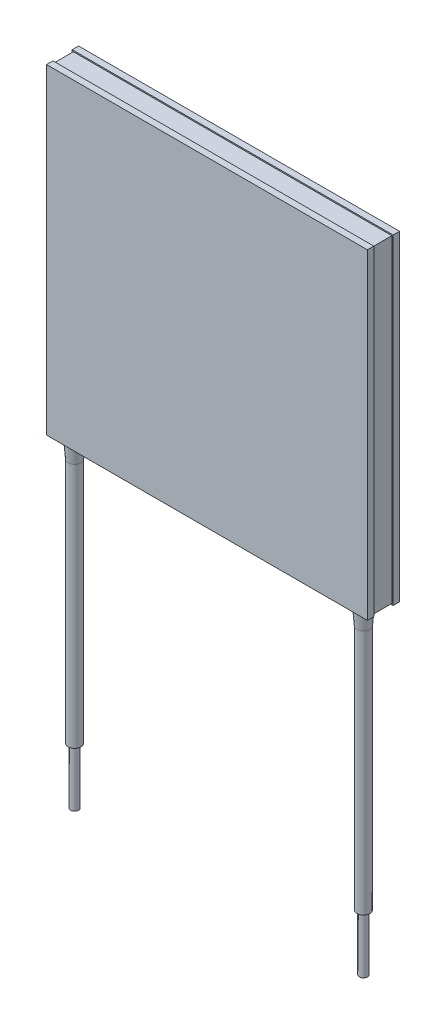
ISO-10303-21;
HEADER;
FILE_DESCRIPTION(('STEP AP214'),'2;1');
FILE_NAME('part.step','',(''),(''),'','','');
FILE_SCHEMA(('AUTOMOTIVE_DESIGN { 1 0 10303 214 1 1 1 1 }'));
ENDSEC;
DATA;
#1=APPLICATION_CONTEXT('core data for automotive mechanical design processes');
#2=APPLICATION_PROTOCOL_DEFINITION('international standard','automotive_design',2000,#1);
#3=PRODUCT_CONTEXT('',#1,'mechanical');
#4=PRODUCT('Part','Part','',(#3));
#5=PRODUCT_RELATED_PRODUCT_CATEGORY('part','',(#4));
#6=PRODUCT_DEFINITION_FORMATION('','',#4);
#7=PRODUCT_DEFINITION_CONTEXT('part definition',#1,'design');
#8=PRODUCT_DEFINITION('design','',#6,#7);
#9=PRODUCT_DEFINITION_SHAPE('','',#8);
#10=(LENGTH_UNIT() NAMED_UNIT(*) SI_UNIT(.MILLI.,.METRE.));
#11=(NAMED_UNIT(*) PLANE_ANGLE_UNIT() SI_UNIT($,.RADIAN.));
#12=(NAMED_UNIT(*) SI_UNIT($,.STERADIAN.) SOLID_ANGLE_UNIT());
#13=UNCERTAINTY_MEASURE_WITH_UNIT(LENGTH_MEASURE(1.E-05),#10,'distance_accuracy_value','');
#14=(GEOMETRIC_REPRESENTATION_CONTEXT(3) GLOBAL_UNCERTAINTY_ASSIGNED_CONTEXT((#13)) GLOBAL_UNIT_ASSIGNED_CONTEXT((#10,
#11,#12)) REPRESENTATION_CONTEXT('',''));
#15=CARTESIAN_POINT('',(0.,0.,0.));
#16=DIRECTION('',(0.,0.,1.));
#17=DIRECTION('',(1.,0.,0.));
#18=AXIS2_PLACEMENT_3D('',#15,#16,#17);
#19=CARTESIAN_POINT('',(17.5,-60.,2.5));
#20=DIRECTION('',(0.,1.,0.));
#21=DIRECTION('',(1.,0.,0.));
#22=AXIS2_PLACEMENT_3D('',#19,#20,#21);
#23=PLANE('',#22);
#24=CARTESIAN_POINT('',(18.,-60.,2.5));
#25=DIRECTION('',(0.,-1.,0.));
#26=DIRECTION('',(1.,0.,0.));
#27=AXIS2_PLACEMENT_3D('',#24,#25,#26);
#28=CIRCLE('',#27,0.5);
#29=CARTESIAN_POINT('',(17.5,-60.,2.5));
#30=VERTEX_POINT('',#29);
#31=EDGE_CURVE('E292',#30,#30,#28,.T.);
#32=ORIENTED_EDGE('',*,*,#31,.T.);
#33=EDGE_LOOP('',(#32));
#34=FACE_BOUND('',#33,.T.);
#35=ADVANCED_FACE('F17',(#34),#23,.F.);
#36=CARTESIAN_POINT('',(17.2,-53.,2.5));
#37=DIRECTION('',(0.,1.,0.));
#38=DIRECTION('',(1.,0.,0.));
#39=AXIS2_PLACEMENT_3D('',#36,#37,#38);
#40=PLANE('',#39);
#41=CARTESIAN_POINT('',(18.,-53.,2.5));
#42=DIRECTION('',(0.,-1.,0.));
#43=DIRECTION('',(1.,0.,0.));
#44=AXIS2_PLACEMENT_3D('',#41,#42,#43);
#45=CIRCLE('',#44,0.5);
#46=CARTESIAN_POINT('',(17.5,-53.,2.5));
#47=VERTEX_POINT('',#46);
#48=EDGE_CURVE('E293',#47,#47,#45,.T.);
#49=ORIENTED_EDGE('',*,*,#48,.F.);
#50=EDGE_LOOP('',(#49));
#51=FACE_BOUND('',#50,.T.);
#52=CARTESIAN_POINT('',(18.,-53.,2.5));
#53=DIRECTION('',(0.,-1.,0.));
#54=DIRECTION('',(1.,0.,0.));
#55=AXIS2_PLACEMENT_3D('',#52,#53,#54);
#56=CIRCLE('',#55,0.8);
#57=CARTESIAN_POINT('',(17.2,-53.,2.5));
#58=VERTEX_POINT('',#57);
#59=EDGE_CURVE('E329',#58,#58,#56,.T.);
#60=ORIENTED_EDGE('',*,*,#59,.T.);
#61=EDGE_LOOP('',(#60));
#62=FACE_BOUND('',#61,.T.);
#63=ADVANCED_FACE('F889',(#51,#62),#40,.F.);
#64=CARTESIAN_POINT('',(-17.5,-60.,2.5));
#65=DIRECTION('',(0.,1.,0.));
#66=DIRECTION('',(1.,0.,0.));
#67=AXIS2_PLACEMENT_3D('',#64,#65,#66);
#68=PLANE('',#67);
#69=CARTESIAN_POINT('',(-18.,-60.,2.5));
#70=DIRECTION('',(0.,1.,0.));
#71=DIRECTION('',(-1.,0.,0.));
#72=AXIS2_PLACEMENT_3D('',#69,#70,#71);
#73=CIRCLE('',#72,0.5);
#74=CARTESIAN_POINT('',(-17.5,-60.,2.5));
#75=VERTEX_POINT('',#74);
#76=EDGE_CURVE('E294',#75,#75,#73,.T.);
#77=ORIENTED_EDGE('',*,*,#76,.F.);
#78=EDGE_LOOP('',(#77));
#79=FACE_BOUND('',#78,.T.);
#80=ADVANCED_FACE('F884',(#79),#68,.F.);
#81=CARTESIAN_POINT('',(-17.2,-53.,2.5));
#82=DIRECTION('',(0.,1.,0.));
#83=DIRECTION('',(1.,0.,0.));
#84=AXIS2_PLACEMENT_3D('',#81,#82,#83);
#85=PLANE('',#84);
#86=CARTESIAN_POINT('',(-18.,-53.,2.5));
#87=DIRECTION('',(0.,1.,0.));
#88=DIRECTION('',(-1.,0.,0.));
#89=AXIS2_PLACEMENT_3D('',#86,#87,#88);
#90=CIRCLE('',#89,0.5);
#91=CARTESIAN_POINT('',(-17.5,-53.,2.5));
#92=VERTEX_POINT('',#91);
#93=EDGE_CURVE('E275',#92,#92,#90,.T.);
#94=ORIENTED_EDGE('',*,*,#93,.T.);
#95=EDGE_LOOP('',(#94));
#96=FACE_BOUND('',#95,.T.);
#97=CARTESIAN_POINT('',(-18.,-53.,2.5));
#98=DIRECTION('',(0.,1.,0.));
#99=DIRECTION('',(-1.,0.,0.));
#100=AXIS2_PLACEMENT_3D('',#97,#98,#99);
#101=CIRCLE('',#100,0.8);
#102=CARTESIAN_POINT('',(-17.2,-53.,2.5));
#103=VERTEX_POINT('',#102);
#104=EDGE_CURVE('E271',#103,#103,#101,.T.);
#105=ORIENTED_EDGE('',*,*,#104,.F.);
#106=EDGE_LOOP('',(#105));
#107=FACE_BOUND('',#106,.T.);
#108=ADVANCED_FACE('F877',(#96,#107),#85,.F.);
#109=CARTESIAN_POINT('',(-19.85,0.,0.));
#110=DIRECTION('',(1.,0.,0.));
#111=DIRECTION('',(0.,-1.,0.));
#112=AXIS2_PLACEMENT_3D('',#109,#110,#111);
#113=PLANE('',#112);
#114=DIRECTION('',(0.,1.,0.));
#115=VECTOR('',#114,1.);
#116=CARTESIAN_POINT('',(-19.85,-20.,0.8));
#117=LINE('',#116,#115);
#118=CARTESIAN_POINT('',(-19.85,-19.85,0.8));
#119=VERTEX_POINT('',#118);
#120=CARTESIAN_POINT('',(-19.85,19.85,0.8));
#121=VERTEX_POINT('',#120);
#122=EDGE_CURVE('E238',#119,#121,#117,.T.);
#123=ORIENTED_EDGE('',*,*,#122,.F.);
#124=DIRECTION('',(0.,0.,-1.));
#125=VECTOR('',#124,1.);
#126=CARTESIAN_POINT('',(-19.85,-19.85,0.));
#127=LINE('',#126,#125);
#128=CARTESIAN_POINT('',(-19.85,-19.85,3.2));
#129=VERTEX_POINT('',#128);
#130=EDGE_CURVE('E11',#129,#119,#127,.T.);
#131=ORIENTED_EDGE('',*,*,#130,.F.);
#132=DIRECTION('',(0.,-1.,0.));
#133=VECTOR('',#132,1.);
#134=CARTESIAN_POINT('',(-19.85,-20.,3.2));
#135=LINE('',#134,#133);
#136=CARTESIAN_POINT('',(-19.85,19.85,3.2));
#137=VERTEX_POINT('',#136);
#138=EDGE_CURVE('E244',#137,#129,#135,.T.);
#139=ORIENTED_EDGE('',*,*,#138,.F.);
#140=DIRECTION('',(0.,0.,1.));
#141=VECTOR('',#140,1.);
#142=CARTESIAN_POINT('',(-19.85,19.85,0.));
#143=LINE('',#142,#141);
#144=EDGE_CURVE('E21',#121,#137,#143,.T.);
#145=ORIENTED_EDGE('',*,*,#144,.F.);
#146=EDGE_LOOP('',(#123,#131,#139,#145));
#147=FACE_BOUND('',#146,.T.);
#148=ADVANCED_FACE('F868',(#147),#113,.F.);
#149=CARTESIAN_POINT('',(0.,-19.85,0.));
#150=DIRECTION('',(0.,1.,0.));
#151=DIRECTION('',(1.,0.,0.));
#152=AXIS2_PLACEMENT_3D('',#149,#150,#151);
#153=PLANE('',#152);
#154=CARTESIAN_POINT('',(18.,-19.85,2.5));
#155=DIRECTION('',(0.,-1.,0.));
#156=DIRECTION('',(0.,0.,1.));
#157=AXIS2_PLACEMENT_3D('',#154,#155,#156);
#158=CIRCLE('',#157,1.);
#159=CARTESIAN_POINT('',(17.2858571571457,-19.85,3.2));
#160=VERTEX_POINT('',#159);
#161=CARTESIAN_POINT('',(17.,-19.85,2.5));
#162=VERTEX_POINT('',#161);
#163=EDGE_CURVE('E231',#160,#162,#158,.T.);
#164=ORIENTED_EDGE('',*,*,#163,.F.);
#165=DIRECTION('',(1.,0.,0.));
#166=VECTOR('',#165,1.);
#167=CARTESIAN_POINT('',(-20.,-19.85,3.2));
#168=LINE('',#167,#166);
#169=CARTESIAN_POINT('',(-17.2858571571457,-19.85,3.2));
#170=VERTEX_POINT('',#169);
#171=EDGE_CURVE('E402',#170,#160,#168,.T.);
#172=ORIENTED_EDGE('',*,*,#171,.F.);
#173=CARTESIAN_POINT('',(-18.,-19.85,2.5));
#174=DIRECTION('',(0.,-1.,0.));
#175=DIRECTION('',(0.,0.,1.));
#176=AXIS2_PLACEMENT_3D('',#173,#174,#175);
#177=CIRCLE('',#176,1.);
#178=CARTESIAN_POINT('',(-17.,-19.85,2.5));
#179=VERTEX_POINT('',#178);
#180=EDGE_CURVE('E263',#179,#170,#177,.T.);
#181=ORIENTED_EDGE('',*,*,#180,.F.);
#182=CARTESIAN_POINT('',(-18.,-19.85,2.5));
#183=DIRECTION('',(0.,-1.,0.));
#184=DIRECTION('',(0.,0.,1.));
#185=AXIS2_PLACEMENT_3D('',#182,#183,#184);
#186=CIRCLE('',#185,1.);
#187=CARTESIAN_POINT('',(-18.7141428428543,-19.85,3.2));
#188=VERTEX_POINT('',#187);
#189=EDGE_CURVE('E315',#188,#179,#186,.T.);
#190=ORIENTED_EDGE('',*,*,#189,.F.);
#191=DIRECTION('',(1.,0.,0.));
#192=VECTOR('',#191,1.);
#193=CARTESIAN_POINT('',(-20.,-19.85,3.2));
#194=LINE('',#193,#192);
#195=EDGE_CURVE('E248',#129,#188,#194,.T.);
#196=ORIENTED_EDGE('',*,*,#195,.F.);
#197=ORIENTED_EDGE('',*,*,#130,.T.);
#198=DIRECTION('',(-1.,0.,0.));
#199=VECTOR('',#198,1.);
#200=CARTESIAN_POINT('',(-20.,-19.85,0.8));
#201=LINE('',#200,#199);
#202=CARTESIAN_POINT('',(19.85,-19.85,0.8));
#203=VERTEX_POINT('',#202);
#204=EDGE_CURVE('E346',#203,#119,#201,.T.);
#205=ORIENTED_EDGE('',*,*,#204,.F.);
#206=DIRECTION('',(0.,0.,-1.));
#207=VECTOR('',#206,1.);
#208=CARTESIAN_POINT('',(19.85,-19.85,0.));
#209=LINE('',#208,#207);
#210=CARTESIAN_POINT('',(19.85,-19.85,3.2));
#211=VERTEX_POINT('',#210);
#212=EDGE_CURVE('E28',#211,#203,#209,.T.);
#213=ORIENTED_EDGE('',*,*,#212,.F.);
#214=DIRECTION('',(1.,0.,0.));
#215=VECTOR('',#214,1.);
#216=CARTESIAN_POINT('',(-20.,-19.85,3.2));
#217=LINE('',#216,#215);
#218=CARTESIAN_POINT('',(18.7141428428543,-19.85,3.2));
#219=VERTEX_POINT('',#218);
#220=EDGE_CURVE('E405',#219,#211,#217,.T.);
#221=ORIENTED_EDGE('',*,*,#220,.F.);
#222=CARTESIAN_POINT('',(18.,-19.85,2.5));
#223=DIRECTION('',(0.,-1.,0.));
#224=DIRECTION('',(0.,0.,1.));
#225=AXIS2_PLACEMENT_3D('',#222,#223,#224);
#226=CIRCLE('',#225,1.);
#227=EDGE_CURVE('E280',#162,#219,#226,.T.);
#228=ORIENTED_EDGE('',*,*,#227,.F.);
#229=EDGE_LOOP('',(#164,#172,#181,#190,#196,#197,#205,#213,#221,#228));
#230=FACE_BOUND('',#229,.T.);
#231=ADVANCED_FACE('F483',(#230),#153,.F.);
#232=CARTESIAN_POINT('',(19.85,0.,0.));
#233=DIRECTION('',(-1.,0.,0.));
#234=DIRECTION('',(0.,1.,0.));
#235=AXIS2_PLACEMENT_3D('',#232,#233,#234);
#236=PLANE('',#235);
#237=DIRECTION('',(0.,-1.,0.));
#238=VECTOR('',#237,1.);
#239=CARTESIAN_POINT('',(19.85,-20.,3.2));
#240=LINE('',#239,#238);
#241=CARTESIAN_POINT('',(19.85,19.85,3.2));
#242=VERTEX_POINT('',#241);
#243=EDGE_CURVE('E409',#242,#211,#240,.T.);
#244=ORIENTED_EDGE('',*,*,#243,.T.);
#245=ORIENTED_EDGE('',*,*,#212,.T.);
#246=DIRECTION('',(0.,1.,0.));
#247=VECTOR('',#246,1.);
#248=CARTESIAN_POINT('',(19.85,-20.,0.8));
#249=LINE('',#248,#247);
#250=CARTESIAN_POINT('',(19.85,19.85,0.8));
#251=VERTEX_POINT('',#250);
#252=EDGE_CURVE('E349',#203,#251,#249,.T.);
#253=ORIENTED_EDGE('',*,*,#252,.T.);
#254=DIRECTION('',(0.,0.,-1.));
#255=VECTOR('',#254,1.);
#256=CARTESIAN_POINT('',(19.85,19.85,0.));
#257=LINE('',#256,#255);
#258=EDGE_CURVE('E284',#242,#251,#257,.T.);
#259=ORIENTED_EDGE('',*,*,#258,.F.);
#260=EDGE_LOOP('',(#244,#245,#253,#259));
#261=FACE_BOUND('',#260,.T.);
#262=ADVANCED_FACE('F487',(#261),#236,.F.);
#263=CARTESIAN_POINT('',(0.,19.85,0.));
#264=DIRECTION('',(0.,-1.,0.));
#265=DIRECTION('',(0.,0.,-1.));
#266=AXIS2_PLACEMENT_3D('',#263,#264,#265);
#267=PLANE('',#266);
#268=DIRECTION('',(-1.,0.,0.));
#269=VECTOR('',#268,1.);
#270=CARTESIAN_POINT('',(-20.,19.85,0.8));
#271=LINE('',#270,#269);
#272=EDGE_CURVE('E242',#251,#121,#271,.T.);
#273=ORIENTED_EDGE('',*,*,#272,.T.);
#274=ORIENTED_EDGE('',*,*,#144,.T.);
#275=DIRECTION('',(1.,0.,0.));
#276=VECTOR('',#275,1.);
#277=CARTESIAN_POINT('',(-20.,19.85,3.2));
#278=LINE('',#277,#276);
#279=EDGE_CURVE('E249',#137,#242,#278,.T.);
#280=ORIENTED_EDGE('',*,*,#279,.T.);
#281=ORIENTED_EDGE('',*,*,#258,.T.);
#282=EDGE_LOOP('',(#273,#274,#280,#281));
#283=FACE_BOUND('',#282,.T.);
#284=ADVANCED_FACE('F19',(#283),#267,.F.);
#285=CARTESIAN_POINT('',(-20.,19.85,0.8));
#286=DIRECTION('',(0.,0.,-1.));
#287=DIRECTION('',(-1.,0.,0.));
#288=AXIS2_PLACEMENT_3D('',#285,#286,#287);
#289=PLANE('',#288);
#290=ORIENTED_EDGE('',*,*,#122,.T.);
#291=ORIENTED_EDGE('',*,*,#272,.F.);
#292=ORIENTED_EDGE('',*,*,#252,.F.);
#293=ORIENTED_EDGE('',*,*,#204,.T.);
#294=EDGE_LOOP('',(#290,#291,#292,#293));
#295=FACE_BOUND('',#294,.T.);
#296=DIRECTION('',(-1.,0.,0.));
#297=VECTOR('',#296,1.);
#298=CARTESIAN_POINT('',(-20.,20.,0.8));
#299=LINE('',#298,#297);
#300=CARTESIAN_POINT('',(20.,20.,0.8));
#301=VERTEX_POINT('',#300);
#302=CARTESIAN_POINT('',(-20.,20.,0.8));
#303=VERTEX_POINT('',#302);
#304=EDGE_CURVE('E192',#301,#303,#299,.T.);
#305=ORIENTED_EDGE('',*,*,#304,.T.);
#306=DIRECTION('',(0.,1.,0.));
#307=VECTOR('',#306,1.);
#308=CARTESIAN_POINT('',(-20.,19.85,0.8));
#309=LINE('',#308,#307);
#310=CARTESIAN_POINT('',(-20.,-20.,0.8));
#311=VERTEX_POINT('',#310);
#312=EDGE_CURVE('E197',#311,#303,#309,.T.);
#313=ORIENTED_EDGE('',*,*,#312,.F.);
#314=DIRECTION('',(1.,0.,0.));
#315=VECTOR('',#314,1.);
#316=CARTESIAN_POINT('',(19.85,-20.,0.8));
#317=LINE('',#316,#315);
#318=CARTESIAN_POINT('',(20.,-20.,0.8));
#319=VERTEX_POINT('',#318);
#320=EDGE_CURVE('E341',#311,#319,#317,.T.);
#321=ORIENTED_EDGE('',*,*,#320,.T.);
#322=DIRECTION('',(0.,1.,0.));
#323=VECTOR('',#322,1.);
#324=CARTESIAN_POINT('',(20.,19.85,0.8));
#325=LINE('',#324,#323);
#326=EDGE_CURVE('E199',#319,#301,#325,.T.);
#327=ORIENTED_EDGE('',*,*,#326,.T.);
#328=EDGE_LOOP('',(#305,#313,#321,#327));
#329=FACE_BOUND('',#328,.T.);
#330=ADVANCED_FACE('F194',(#295,#329),#289,.F.);
#331=CARTESIAN_POINT('',(0.,0.,0.));
#332=DIRECTION('',(0.,0.,1.));
#333=DIRECTION('',(1.,0.,0.));
#334=AXIS2_PLACEMENT_3D('',#331,#332,#333);
#335=PLANE('',#334);
#336=DIRECTION('',(0.,1.,0.));
#337=VECTOR('',#336,1.);
#338=CARTESIAN_POINT('',(20.,20.,0.));
#339=LINE('',#338,#337);
#340=CARTESIAN_POINT('',(20.,-20.,0.));
#341=VERTEX_POINT('',#340);
#342=CARTESIAN_POINT('',(20.,20.,0.));
#343=VERTEX_POINT('',#342);
#344=EDGE_CURVE('E316',#341,#343,#339,.T.);
#345=ORIENTED_EDGE('',*,*,#344,.F.);
#346=DIRECTION('',(1.,0.,0.));
#347=VECTOR('',#346,1.);
#348=CARTESIAN_POINT('',(-20.,-20.,0.));
#349=LINE('',#348,#347);
#350=CARTESIAN_POINT('',(-20.,-20.,0.));
#351=VERTEX_POINT('',#350);
#352=EDGE_CURVE('E344',#351,#341,#349,.T.);
#353=ORIENTED_EDGE('',*,*,#352,.F.);
#354=DIRECTION('',(0.,-1.,0.));
#355=VECTOR('',#354,1.);
#356=CARTESIAN_POINT('',(-20.,20.,0.));
#357=LINE('',#356,#355);
#358=CARTESIAN_POINT('',(-20.,20.,0.));
#359=VERTEX_POINT('',#358);
#360=EDGE_CURVE('E216',#359,#351,#357,.T.);
#361=ORIENTED_EDGE('',*,*,#360,.F.);
#362=DIRECTION('',(-1.,0.,0.));
#363=VECTOR('',#362,1.);
#364=CARTESIAN_POINT('',(-20.,20.,0.));
#365=LINE('',#364,#363);
#366=EDGE_CURVE('E211',#343,#359,#365,.T.);
#367=ORIENTED_EDGE('',*,*,#366,.F.);
#368=EDGE_LOOP('',(#345,#353,#361,#367));
#369=FACE_BOUND('',#368,.T.);
#370=ADVANCED_FACE('F820',(#369),#335,.F.);
#371=CARTESIAN_POINT('',(0.,0.,4.));
#372=DIRECTION('',(0.,0.,1.));
#373=DIRECTION('',(1.,0.,0.));
#374=AXIS2_PLACEMENT_3D('',#371,#372,#373);
#375=PLANE('',#374);
#376=DIRECTION('',(0.,1.,0.));
#377=VECTOR('',#376,1.);
#378=CARTESIAN_POINT('',(20.,20.,4.));
#379=LINE('',#378,#377);
#380=CARTESIAN_POINT('',(20.,-20.,4.));
#381=VERTEX_POINT('',#380);
#382=CARTESIAN_POINT('',(20.,20.,4.));
#383=VERTEX_POINT('',#382);
#384=EDGE_CURVE('E205',#381,#383,#379,.T.);
#385=ORIENTED_EDGE('',*,*,#384,.T.);
#386=DIRECTION('',(-1.,0.,0.));
#387=VECTOR('',#386,1.);
#388=CARTESIAN_POINT('',(-20.,20.,4.));
#389=LINE('',#388,#387);
#390=CARTESIAN_POINT('',(-20.,20.,4.));
#391=VERTEX_POINT('',#390);
#392=EDGE_CURVE('E243',#383,#391,#389,.T.);
#393=ORIENTED_EDGE('',*,*,#392,.T.);
#394=DIRECTION('',(0.,-1.,0.));
#395=VECTOR('',#394,1.);
#396=CARTESIAN_POINT('',(-20.,20.,4.));
#397=LINE('',#396,#395);
#398=CARTESIAN_POINT('',(-20.,-20.,4.));
#399=VERTEX_POINT('',#398);
#400=EDGE_CURVE('E233',#391,#399,#397,.T.);
#401=ORIENTED_EDGE('',*,*,#400,.T.);
#402=DIRECTION('',(1.,0.,0.));
#403=VECTOR('',#402,1.);
#404=CARTESIAN_POINT('',(-20.,-20.,4.));
#405=LINE('',#404,#403);
#406=EDGE_CURVE('E345',#399,#381,#405,.T.);
#407=ORIENTED_EDGE('',*,*,#406,.T.);
#408=EDGE_LOOP('',(#385,#393,#401,#407));
#409=FACE_BOUND('',#408,.T.);
#410=ADVANCED_FACE('F432',(#409),#375,.T.);
#411=CARTESIAN_POINT('',(-20.,20.,4.));
#412=DIRECTION('',(0.,-1.,0.));
#413=DIRECTION('',(0.,0.,-1.));
#414=AXIS2_PLACEMENT_3D('',#411,#412,#413);
#415=PLANE('',#414);
#416=DIRECTION('',(0.,0.,-1.));
#417=VECTOR('',#416,1.);
#418=CARTESIAN_POINT('',(20.,20.,4.));
#419=LINE('',#418,#417);
#420=CARTESIAN_POINT('',(20.,20.,3.2));
#421=VERTEX_POINT('',#420);
#422=EDGE_CURVE('E303',#383,#421,#419,.T.);
#423=ORIENTED_EDGE('',*,*,#422,.T.);
#424=DIRECTION('',(1.,0.,0.));
#425=VECTOR('',#424,1.);
#426=CARTESIAN_POINT('',(-20.,20.,3.2));
#427=LINE('',#426,#425);
#428=CARTESIAN_POINT('',(-20.,20.,3.2));
#429=VERTEX_POINT('',#428);
#430=EDGE_CURVE('E254',#429,#421,#427,.T.);
#431=ORIENTED_EDGE('',*,*,#430,.F.);
#432=DIRECTION('',(0.,0.,-1.));
#433=VECTOR('',#432,1.);
#434=CARTESIAN_POINT('',(-20.,20.,4.));
#435=LINE('',#434,#433);
#436=EDGE_CURVE('E227',#391,#429,#435,.T.);
#437=ORIENTED_EDGE('',*,*,#436,.F.);
#438=ORIENTED_EDGE('',*,*,#392,.F.);
#439=EDGE_LOOP('',(#423,#431,#437,#438));
#440=FACE_BOUND('',#439,.T.);
#441=ADVANCED_FACE('F452',(#440),#415,.F.);
#442=CARTESIAN_POINT('',(20.,20.,4.));
#443=DIRECTION('',(-1.,0.,0.));
#444=DIRECTION('',(0.,1.,0.));
#445=AXIS2_PLACEMENT_3D('',#442,#443,#444);
#446=PLANE('',#445);
#447=ORIENTED_EDGE('',*,*,#326,.F.);
#448=DIRECTION('',(0.,0.,-1.));
#449=VECTOR('',#448,1.);
#450=CARTESIAN_POINT('',(20.,-20.,4.));
#451=LINE('',#450,#449);
#452=EDGE_CURVE('E306',#319,#341,#451,.T.);
#453=ORIENTED_EDGE('',*,*,#452,.T.);
#454=ORIENTED_EDGE('',*,*,#344,.T.);
#455=DIRECTION('',(0.,0.,-1.));
#456=VECTOR('',#455,1.);
#457=CARTESIAN_POINT('',(20.,20.,4.));
#458=LINE('',#457,#456);
#459=EDGE_CURVE('E204',#301,#343,#458,.T.);
#460=ORIENTED_EDGE('',*,*,#459,.F.);
#461=EDGE_LOOP('',(#447,#453,#454,#460));
#462=FACE_BOUND('',#461,.T.);
#463=ADVANCED_FACE('F791',(#462),#446,.F.);
#464=CARTESIAN_POINT('',(-20.,20.,4.));
#465=DIRECTION('',(0.,-1.,0.));
#466=DIRECTION('',(0.,0.,-1.));
#467=AXIS2_PLACEMENT_3D('',#464,#465,#466);
#468=PLANE('',#467);
#469=DIRECTION('',(0.,0.,-1.));
#470=VECTOR('',#469,1.);
#471=CARTESIAN_POINT('',(-20.,20.,4.));
#472=LINE('',#471,#470);
#473=EDGE_CURVE('E208',#303,#359,#472,.T.);
#474=ORIENTED_EDGE('',*,*,#473,.F.);
#475=ORIENTED_EDGE('',*,*,#304,.F.);
#476=ORIENTED_EDGE('',*,*,#459,.T.);
#477=ORIENTED_EDGE('',*,*,#366,.T.);
#478=EDGE_LOOP('',(#474,#475,#476,#477));
#479=FACE_BOUND('',#478,.T.);
#480=ADVANCED_FACE('F209',(#479),#468,.F.);
#481=CARTESIAN_POINT('',(20.,20.,4.));
#482=DIRECTION('',(-1.,0.,0.));
#483=DIRECTION('',(0.,1.,0.));
#484=AXIS2_PLACEMENT_3D('',#481,#482,#483);
#485=PLANE('',#484);
#486=DIRECTION('',(0.,0.,-1.));
#487=VECTOR('',#486,1.);
#488=CARTESIAN_POINT('',(20.,-20.,4.));
#489=LINE('',#488,#487);
#490=CARTESIAN_POINT('',(20.,-20.,3.2));
#491=VERTEX_POINT('',#490);
#492=EDGE_CURVE('E350',#381,#491,#489,.T.);
#493=ORIENTED_EDGE('',*,*,#492,.T.);
#494=DIRECTION('',(0.,1.,0.));
#495=VECTOR('',#494,1.);
#496=CARTESIAN_POINT('',(20.,19.85,3.2));
#497=LINE('',#496,#495);
#498=EDGE_CURVE('E298',#491,#421,#497,.T.);
#499=ORIENTED_EDGE('',*,*,#498,.T.);
#500=ORIENTED_EDGE('',*,*,#422,.F.);
#501=ORIENTED_EDGE('',*,*,#384,.F.);
#502=EDGE_LOOP('',(#493,#499,#500,#501));
#503=FACE_BOUND('',#502,.T.);
#504=ADVANCED_FACE('F445',(#503),#485,.F.);
#505=CARTESIAN_POINT('',(-20.,-20.,4.));
#506=DIRECTION('',(0.,1.,0.));
#507=DIRECTION('',(1.,0.,0.));
#508=AXIS2_PLACEMENT_3D('',#505,#506,#507);
#509=PLANE('',#508);
#510=ORIENTED_EDGE('',*,*,#320,.F.);
#511=DIRECTION('',(0.,0.,-1.));
#512=VECTOR('',#511,1.);
#513=CARTESIAN_POINT('',(-20.,-20.,4.));
#514=LINE('',#513,#512);
#515=EDGE_CURVE('E220',#311,#351,#514,.T.);
#516=ORIENTED_EDGE('',*,*,#515,.T.);
#517=ORIENTED_EDGE('',*,*,#352,.T.);
#518=ORIENTED_EDGE('',*,*,#452,.F.);
#519=EDGE_LOOP('',(#510,#516,#517,#518));
#520=FACE_BOUND('',#519,.T.);
#521=ADVANCED_FACE('F762',(#520),#509,.F.);
#522=CARTESIAN_POINT('',(-20.,-20.,4.));
#523=DIRECTION('',(0.,1.,0.));
#524=DIRECTION('',(1.,0.,0.));
#525=AXIS2_PLACEMENT_3D('',#522,#523,#524);
#526=PLANE('',#525);
#527=CARTESIAN_POINT('',(18.,-20.,2.5));
#528=DIRECTION('',(0.,-1.,0.));
#529=DIRECTION('',(0.,0.,1.));
#530=AXIS2_PLACEMENT_3D('',#527,#528,#529);
#531=CIRCLE('',#530,0.988);
#532=CARTESIAN_POINT('',(18.697240274224,-20.,3.2));
#533=VERTEX_POINT('',#532);
#534=CARTESIAN_POINT('',(17.302759725776,-20.,3.2));
#535=VERTEX_POINT('',#534);
#536=EDGE_CURVE('E356',#533,#535,#531,.T.);
#537=ORIENTED_EDGE('',*,*,#536,.F.);
#538=DIRECTION('',(1.,0.,0.));
#539=VECTOR('',#538,1.);
#540=CARTESIAN_POINT('',(19.85,-20.,3.2));
#541=LINE('',#540,#539);
#542=EDGE_CURVE('E302',#533,#491,#541,.T.);
#543=ORIENTED_EDGE('',*,*,#542,.T.);
#544=ORIENTED_EDGE('',*,*,#492,.F.);
#545=ORIENTED_EDGE('',*,*,#406,.F.);
#546=DIRECTION('',(0.,0.,-1.));
#547=VECTOR('',#546,1.);
#548=CARTESIAN_POINT('',(-20.,-20.,4.));
#549=LINE('',#548,#547);
#550=CARTESIAN_POINT('',(-20.,-20.,3.2));
#551=VERTEX_POINT('',#550);
#552=EDGE_CURVE('E237',#399,#551,#549,.T.);
#553=ORIENTED_EDGE('',*,*,#552,.T.);
#554=DIRECTION('',(1.,0.,0.));
#555=VECTOR('',#554,1.);
#556=CARTESIAN_POINT('',(19.85,-20.,3.2));
#557=LINE('',#556,#555);
#558=CARTESIAN_POINT('',(-18.697240274224,-20.,3.2));
#559=VERTEX_POINT('',#558);
#560=EDGE_CURVE('E255',#551,#559,#557,.T.);
#561=ORIENTED_EDGE('',*,*,#560,.T.);
#562=CARTESIAN_POINT('',(-18.,-20.,2.5));
#563=DIRECTION('',(0.,-1.,0.));
#564=DIRECTION('',(0.,0.,1.));
#565=AXIS2_PLACEMENT_3D('',#562,#563,#564);
#566=CIRCLE('',#565,0.988);
#567=CARTESIAN_POINT('',(-17.302759725776,-20.,3.2));
#568=VERTEX_POINT('',#567);
#569=EDGE_CURVE('E262',#568,#559,#566,.T.);
#570=ORIENTED_EDGE('',*,*,#569,.F.);
#571=DIRECTION('',(1.,0.,0.));
#572=VECTOR('',#571,1.);
#573=CARTESIAN_POINT('',(19.85,-20.,3.2));
#574=LINE('',#573,#572);
#575=EDGE_CURVE('E338',#568,#535,#574,.T.);
#576=ORIENTED_EDGE('',*,*,#575,.T.);
#577=EDGE_LOOP('',(#537,#543,#544,#545,#553,#561,#570,#576));
#578=FACE_BOUND('',#577,.T.);
#579=ADVANCED_FACE('F442',(#578),#526,.F.);
#580=CARTESIAN_POINT('',(-20.,20.,4.));
#581=DIRECTION('',(1.,0.,0.));
#582=DIRECTION('',(0.,1.,0.));
#583=AXIS2_PLACEMENT_3D('',#580,#581,#582);
#584=PLANE('',#583);
#585=ORIENTED_EDGE('',*,*,#515,.F.);
#586=ORIENTED_EDGE('',*,*,#312,.T.);
#587=ORIENTED_EDGE('',*,*,#473,.T.);
#588=ORIENTED_EDGE('',*,*,#360,.T.);
#589=EDGE_LOOP('',(#585,#586,#587,#588));
#590=FACE_BOUND('',#589,.T.);
#591=ADVANCED_FACE('F218',(#590),#584,.F.);
#592=CARTESIAN_POINT('',(-20.,20.,4.));
#593=DIRECTION('',(1.,0.,0.));
#594=DIRECTION('',(0.,1.,0.));
#595=AXIS2_PLACEMENT_3D('',#592,#593,#594);
#596=PLANE('',#595);
#597=DIRECTION('',(0.,1.,0.));
#598=VECTOR('',#597,1.);
#599=CARTESIAN_POINT('',(-20.,19.85,3.2));
#600=LINE('',#599,#598);
#601=EDGE_CURVE('E250',#551,#429,#600,.T.);
#602=ORIENTED_EDGE('',*,*,#601,.F.);
#603=ORIENTED_EDGE('',*,*,#552,.F.);
#604=ORIENTED_EDGE('',*,*,#400,.F.);
#605=ORIENTED_EDGE('',*,*,#436,.T.);
#606=EDGE_LOOP('',(#602,#603,#604,#605));
#607=FACE_BOUND('',#606,.T.);
#608=ADVANCED_FACE('F456',(#607),#596,.F.);
#609=CARTESIAN_POINT('',(-20.,19.85,3.2));
#610=DIRECTION('',(0.,0.,1.));
#611=DIRECTION('',(1.,0.,0.));
#612=AXIS2_PLACEMENT_3D('',#609,#610,#611);
#613=PLANE('',#612);
#614=CARTESIAN_POINT('',(18.7141428428543,-19.85,3.2));
#615=CARTESIAN_POINT('',(18.7085413145216,-19.9000036420978,3.2));
#616=CARTESIAN_POINT('',(18.7029078781854,-19.950004026566,3.2));
#617=CARTESIAN_POINT('',(18.697240274224,-20.,3.2));
#618=(BOUNDED_CURVE() B_SPLINE_CURVE(3,(#614,#615,#616,#617),.UNSPECIFIED.,.F.,
.F.) B_SPLINE_CURVE_WITH_KNOTS((4,4),(0.00177126621246471,0.00192221302484469),
.UNSPECIFIED.) CURVE() GEOMETRIC_REPRESENTATION_ITEM() RATIONAL_B_SPLINE_CURVE((1.,1.,1.,1.)) REPRESENTATION_ITEM(''));
#619=EDGE_CURVE('E360',#219,#533,#618,.T.);
#620=ORIENTED_EDGE('',*,*,#619,.F.);
#621=ORIENTED_EDGE('',*,*,#220,.T.);
#622=ORIENTED_EDGE('',*,*,#243,.F.);
#623=ORIENTED_EDGE('',*,*,#279,.F.);
#624=ORIENTED_EDGE('',*,*,#138,.T.);
#625=ORIENTED_EDGE('',*,*,#195,.T.);
#626=CARTESIAN_POINT('',(-18.697240274224,-20.,3.2));
#627=CARTESIAN_POINT('',(-18.7029079090042,-19.9500037547028,3.2));
#628=CARTESIAN_POINT('',(-18.7085413254622,-19.9000035444338,3.2));
#629=CARTESIAN_POINT('',(-18.7141428428543,-19.85,3.2));
#630=(BOUNDED_CURVE() B_SPLINE_CURVE(3,(#626,#627,#628,#629),.UNSPECIFIED.,.F.,
.F.) B_SPLINE_CURVE_WITH_KNOTS((4,4),(0.00176171988814776,0.00191266054009144),
.UNSPECIFIED.) CURVE() GEOMETRIC_REPRESENTATION_ITEM() RATIONAL_B_SPLINE_CURVE((1.,1.,1.,1.)) REPRESENTATION_ITEM(''));
#631=EDGE_CURVE('E272',#559,#188,#630,.T.);
#632=ORIENTED_EDGE('',*,*,#631,.F.);
#633=ORIENTED_EDGE('',*,*,#560,.F.);
#634=ORIENTED_EDGE('',*,*,#601,.T.);
#635=ORIENTED_EDGE('',*,*,#430,.T.);
#636=ORIENTED_EDGE('',*,*,#498,.F.);
#637=ORIENTED_EDGE('',*,*,#542,.F.);
#638=EDGE_LOOP('',(#620,#621,#622,#623,#624,#625,#632,#633,#634,#635,#636,#637));
#639=FACE_BOUND('',#638,.T.);
#640=ADVANCED_FACE('F463',(#639),#613,.F.);
#641=CARTESIAN_POINT('',(-20.,19.85,3.2));
#642=DIRECTION('',(0.,0.,1.));
#643=DIRECTION('',(1.,0.,0.));
#644=AXIS2_PLACEMENT_3D('',#641,#642,#643);
#645=PLANE('',#644);
#646=CARTESIAN_POINT('',(17.302759725776,-20.,3.2));
#647=CARTESIAN_POINT('',(17.2970920909959,-19.9500037547028,3.2));
#648=CARTESIAN_POINT('',(17.2914586745378,-19.9000035444338,3.2));
#649=CARTESIAN_POINT('',(17.2858571571457,-19.85,3.2));
#650=(BOUNDED_CURVE() B_SPLINE_CURVE(3,(#646,#647,#648,#649),.UNSPECIFIED.,.F.,
.F.) B_SPLINE_CURVE_WITH_KNOTS((4,4),(0.00176171988814777,0.00191266054009144),
.UNSPECIFIED.) CURVE() GEOMETRIC_REPRESENTATION_ITEM() RATIONAL_B_SPLINE_CURVE((1.,1.,1.,1.)) REPRESENTATION_ITEM(''));
#651=EDGE_CURVE('E330',#535,#160,#650,.T.);
#652=ORIENTED_EDGE('',*,*,#651,.F.);
#653=ORIENTED_EDGE('',*,*,#575,.F.);
#654=CARTESIAN_POINT('',(-17.2858571571457,-19.85,3.2));
#655=CARTESIAN_POINT('',(-17.2914586854784,-19.9000036420978,3.2));
#656=CARTESIAN_POINT('',(-17.2970921218146,-19.950004026566,3.2));
#657=CARTESIAN_POINT('',(-17.302759725776,-20.,3.2));
#658=(BOUNDED_CURVE() B_SPLINE_CURVE(3,(#654,#655,#656,#657),.UNSPECIFIED.,.F.,
.F.) B_SPLINE_CURVE_WITH_KNOTS((4,4),(0.00177126621246471,0.0019222130248447),
.UNSPECIFIED.) CURVE() GEOMETRIC_REPRESENTATION_ITEM() RATIONAL_B_SPLINE_CURVE((1.,1.,1.,1.)) REPRESENTATION_ITEM(''));
#659=EDGE_CURVE('E256',#170,#568,#658,.T.);
#660=ORIENTED_EDGE('',*,*,#659,.F.);
#661=ORIENTED_EDGE('',*,*,#171,.T.);
#662=EDGE_LOOP('',(#652,#653,#660,#661));
#663=FACE_BOUND('',#662,.T.);
#664=ADVANCED_FACE('F473',(#663),#645,.F.);
#665=CARTESIAN_POINT('',(18.,-19.85,2.5));
#666=DIRECTION('',(0.,1.,0.));
#667=DIRECTION('',(1.,0.,0.));
#668=AXIS2_PLACEMENT_3D('',#665,#666,#667);
#669=CYLINDRICAL_SURFACE('',#668,0.5);
#670=ORIENTED_EDGE('',*,*,#48,.T.);
#671=DIRECTION('',(0.,-1.,0.));
#672=VECTOR('',#671,1.);
#673=CARTESIAN_POINT('',(17.5,-19.85,2.5));
#674=LINE('',#673,#672);
#675=EDGE_CURVE('E288',#47,#30,#674,.T.);
#676=ORIENTED_EDGE('',*,*,#675,.T.);
#677=ORIENTED_EDGE('',*,*,#31,.F.);
#678=ORIENTED_EDGE('',*,*,#675,.F.);
#679=EDGE_LOOP('',(#670,#676,#677,#678));
#680=FACE_BOUND('',#679,.T.);
#681=ADVANCED_FACE('F710',(#680),#669,.T.);
#682=CARTESIAN_POINT('',(18.,-19.85,2.5));
#683=DIRECTION('',(0.,1.,0.));
#684=DIRECTION('',(1.,0.,0.));
#685=AXIS2_PLACEMENT_3D('',#682,#683,#684);
#686=CYLINDRICAL_SURFACE('',#685,0.8);
#687=CARTESIAN_POINT('',(18.,-22.35,2.5));
#688=DIRECTION('',(0.,-1.,0.));
#689=DIRECTION('',(1.,0.,0.));
#690=AXIS2_PLACEMENT_3D('',#687,#688,#689);
#691=CIRCLE('',#690,0.8);
#692=CARTESIAN_POINT('',(17.2,-22.35,2.5));
#693=VERTEX_POINT('',#692);
#694=EDGE_CURVE('E276',#693,#693,#691,.T.);
#695=ORIENTED_EDGE('',*,*,#694,.T.);
#696=DIRECTION('',(0.,-1.,0.));
#697=VECTOR('',#696,1.);
#698=CARTESIAN_POINT('',(17.2,-19.85,2.5));
#699=LINE('',#698,#697);
#700=EDGE_CURVE('E326',#693,#58,#699,.T.);
#701=ORIENTED_EDGE('',*,*,#700,.T.);
#702=ORIENTED_EDGE('',*,*,#59,.F.);
#703=ORIENTED_EDGE('',*,*,#700,.F.);
#704=EDGE_LOOP('',(#695,#701,#702,#703));
#705=FACE_BOUND('',#704,.T.);
#706=ADVANCED_FACE('F702',(#705),#686,.T.);
#707=CARTESIAN_POINT('',(18.,-22.35,2.5));
#708=DIRECTION('',(0.,1.,0.));
#709=DIRECTION('',(1.,0.,0.));
#710=AXIS2_PLACEMENT_3D('',#707,#708,#709);
#711=CONICAL_SURFACE('',#710,0.8,0.0798299857122393);
#712=ORIENTED_EDGE('',*,*,#163,.T.);
#713=DIRECTION('',(0.0797452222828921,-0.996815278536125,0.));
#714=VECTOR('',#713,1.);
#715=CARTESIAN_POINT('',(17.2,-22.35,2.5));
#716=LINE('',#715,#714);
#717=EDGE_CURVE('E281',#162,#693,#716,.T.);
#718=ORIENTED_EDGE('',*,*,#717,.T.);
#719=ORIENTED_EDGE('',*,*,#694,.F.);
#720=ORIENTED_EDGE('',*,*,#717,.F.);
#721=ORIENTED_EDGE('',*,*,#227,.T.);
#722=ORIENTED_EDGE('',*,*,#619,.T.);
#723=ORIENTED_EDGE('',*,*,#536,.T.);
#724=ORIENTED_EDGE('',*,*,#651,.T.);
#725=EDGE_LOOP('',(#712,#718,#719,#720,#721,#722,#723,#724));
#726=FACE_BOUND('',#725,.T.);
#727=ADVANCED_FACE('F476',(#726),#711,.T.);
#728=CARTESIAN_POINT('',(-18.,-19.85,2.5));
#729=DIRECTION('',(0.,1.,0.));
#730=DIRECTION('',(-1.,0.,0.));
#731=AXIS2_PLACEMENT_3D('',#728,#729,#730);
#732=CYLINDRICAL_SURFACE('',#731,0.5);
#733=ORIENTED_EDGE('',*,*,#93,.F.);
#734=DIRECTION('',(0.,-1.,0.));
#735=VECTOR('',#734,1.);
#736=CARTESIAN_POINT('',(-17.5,-19.85,2.5));
#737=LINE('',#736,#735);
#738=EDGE_CURVE('E297',#92,#75,#737,.T.);
#739=ORIENTED_EDGE('',*,*,#738,.T.);
#740=ORIENTED_EDGE('',*,*,#76,.T.);
#741=ORIENTED_EDGE('',*,*,#738,.F.);
#742=EDGE_LOOP('',(#733,#739,#740,#741));
#743=FACE_BOUND('',#742,.T.);
#744=ADVANCED_FACE('F685',(#743),#732,.T.);
#745=CARTESIAN_POINT('',(-18.,-19.85,2.5));
#746=DIRECTION('',(0.,1.,0.));
#747=DIRECTION('',(-1.,0.,0.));
#748=AXIS2_PLACEMENT_3D('',#745,#746,#747);
#749=CYLINDRICAL_SURFACE('',#748,0.8);
#750=CARTESIAN_POINT('',(-18.,-22.35,2.5));
#751=DIRECTION('',(0.,1.,0.));
#752=DIRECTION('',(-1.,0.,0.));
#753=AXIS2_PLACEMENT_3D('',#750,#751,#752);
#754=CIRCLE('',#753,0.8);
#755=CARTESIAN_POINT('',(-17.2,-22.35,2.5));
#756=VERTEX_POINT('',#755);
#757=EDGE_CURVE('E314',#756,#756,#754,.T.);
#758=ORIENTED_EDGE('',*,*,#757,.F.);
#759=DIRECTION('',(0.,-1.,0.));
#760=VECTOR('',#759,1.);
#761=CARTESIAN_POINT('',(-17.2,-19.85,2.5));
#762=LINE('',#761,#760);
#763=EDGE_CURVE('E264',#756,#103,#762,.T.);
#764=ORIENTED_EDGE('',*,*,#763,.T.);
#765=ORIENTED_EDGE('',*,*,#104,.T.);
#766=ORIENTED_EDGE('',*,*,#763,.F.);
#767=EDGE_LOOP('',(#758,#764,#765,#766));
#768=FACE_BOUND('',#767,.T.);
#769=ADVANCED_FACE('F676',(#768),#749,.T.);
#770=CARTESIAN_POINT('',(-18.,-22.35,2.5));
#771=DIRECTION('',(0.,1.,0.));
#772=DIRECTION('',(-1.,0.,0.));
#773=AXIS2_PLACEMENT_3D('',#770,#771,#772);
#774=CONICAL_SURFACE('',#773,0.8,0.0798299857122393);
#775=ORIENTED_EDGE('',*,*,#189,.T.);
#776=DIRECTION('',(-0.0797452222828921,-0.996815278536125,0.));
#777=VECTOR('',#776,1.);
#778=CARTESIAN_POINT('',(-17.2,-22.35,2.5));
#779=LINE('',#778,#777);
#780=EDGE_CURVE('E310',#179,#756,#779,.T.);
#781=ORIENTED_EDGE('',*,*,#780,.T.);
#782=ORIENTED_EDGE('',*,*,#757,.T.);
#783=ORIENTED_EDGE('',*,*,#780,.F.);
#784=ORIENTED_EDGE('',*,*,#180,.T.);
#785=ORIENTED_EDGE('',*,*,#659,.T.);
#786=ORIENTED_EDGE('',*,*,#569,.T.);
#787=ORIENTED_EDGE('',*,*,#631,.T.);
#788=EDGE_LOOP('',(#775,#781,#782,#783,#784,#785,#786,#787));
#789=FACE_BOUND('',#788,.T.);
#790=ADVANCED_FACE('F468',(#789),#774,.T.);
#791=CLOSED_SHELL('',(#35,#63,#80,#108,#148,#231,#262,#284,#330,#370,#410,#441,#463,#480,#504,
#521,#579,#591,#608,#640,#664,#681,#706,#727,#744,#769,#790));
#792=MANIFOLD_SOLID_BREP('B1',#791);
#793=ADVANCED_BREP_SHAPE_REPRESENTATION('',(#18,#792),#14);
#794=SHAPE_DEFINITION_REPRESENTATION(#9,#793);
ENDSEC;
END-ISO-10303-21;
